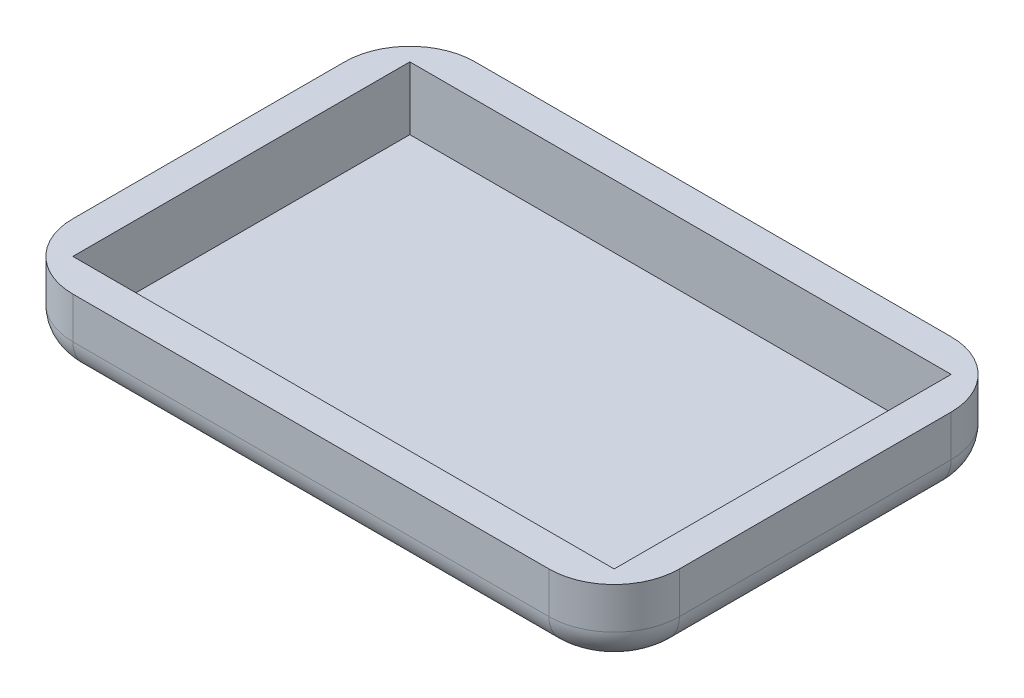
ISO-10303-21;
HEADER;
FILE_DESCRIPTION(('STEP AP214'),'2;1');
FILE_NAME('part.step','',(''),(''),'','','');
FILE_SCHEMA(('AUTOMOTIVE_DESIGN { 1 0 10303 214 1 1 1 1 }'));
ENDSEC;
DATA;
#1=APPLICATION_CONTEXT('core data for automotive mechanical design processes');
#2=APPLICATION_PROTOCOL_DEFINITION('international standard','automotive_design',2000,#1);
#3=PRODUCT_CONTEXT('',#1,'mechanical');
#4=PRODUCT('Part','Part','',(#3));
#5=PRODUCT_RELATED_PRODUCT_CATEGORY('part','',(#4));
#6=PRODUCT_DEFINITION_FORMATION('','',#4);
#7=PRODUCT_DEFINITION_CONTEXT('part definition',#1,'design');
#8=PRODUCT_DEFINITION('design','',#6,#7);
#9=PRODUCT_DEFINITION_SHAPE('','',#8);
#10=(LENGTH_UNIT() NAMED_UNIT(*) SI_UNIT(.MILLI.,.METRE.));
#11=(NAMED_UNIT(*) PLANE_ANGLE_UNIT() SI_UNIT($,.RADIAN.));
#12=(NAMED_UNIT(*) SI_UNIT($,.STERADIAN.) SOLID_ANGLE_UNIT());
#13=UNCERTAINTY_MEASURE_WITH_UNIT(LENGTH_MEASURE(1.E-05),#10,'distance_accuracy_value','');
#14=(GEOMETRIC_REPRESENTATION_CONTEXT(3) GLOBAL_UNCERTAINTY_ASSIGNED_CONTEXT((#13)) GLOBAL_UNIT_ASSIGNED_CONTEXT((#10,
#11,#12)) REPRESENTATION_CONTEXT('',''));
#15=CARTESIAN_POINT('',(0.,0.,0.));
#16=DIRECTION('',(0.,0.,1.));
#17=DIRECTION('',(1.,0.,0.));
#18=AXIS2_PLACEMENT_3D('',#15,#16,#17);
#19=CARTESIAN_POINT('',(0.,8.636,0.));
#20=DIRECTION('',(1.,0.,0.));
#21=DIRECTION('',(0.,0.,-1.));
#22=AXIS2_PLACEMENT_3D('',#19,#20,#21);
#23=PLANE('',#22);
#24=DIRECTION('',(0.,-1.,0.));
#25=VECTOR('',#24,1.);
#26=CARTESIAN_POINT('',(0.,8.636,-39.37));
#27=LINE('',#26,#25);
#28=CARTESIAN_POINT('',(0.,8.636,-39.37));
#29=VERTEX_POINT('',#28);
#30=CARTESIAN_POINT('',(0.,3.81,-39.37));
#31=VERTEX_POINT('',#30);
#32=EDGE_CURVE('E225',#29,#31,#27,.T.);
#33=ORIENTED_EDGE('',*,*,#32,.T.);
#34=DIRECTION('',(0.,0.,1.));
#35=VECTOR('',#34,1.);
#36=CARTESIAN_POINT('',(0.,3.81,-7.62));
#37=LINE('',#36,#35);
#38=CARTESIAN_POINT('',(0.,3.81,-7.62));
#39=VERTEX_POINT('',#38);
#40=EDGE_CURVE('E257',#31,#39,#37,.T.);
#41=ORIENTED_EDGE('',*,*,#40,.T.);
#42=DIRECTION('',(0.,-1.,0.));
#43=VECTOR('',#42,1.);
#44=CARTESIAN_POINT('',(0.,8.636,-7.62));
#45=LINE('',#44,#43);
#46=CARTESIAN_POINT('',(0.,8.636,-7.62));
#47=VERTEX_POINT('',#46);
#48=EDGE_CURVE('E227',#39,#47,#45,.F.);
#49=ORIENTED_EDGE('',*,*,#48,.T.);
#50=DIRECTION('',(0.,0.,1.));
#51=VECTOR('',#50,1.);
#52=CARTESIAN_POINT('',(0.,8.636,0.));
#53=LINE('',#52,#51);
#54=EDGE_CURVE('E188',#29,#47,#53,.T.);
#55=ORIENTED_EDGE('',*,*,#54,.F.);
#56=EDGE_LOOP('',(#33,#41,#49,#55));
#57=FACE_BOUND('',#56,.T.);
#58=ADVANCED_FACE('F35',(#57),#23,.F.);
#59=CARTESIAN_POINT('',(0.,8.636,0.));
#60=DIRECTION('',(0.,0.,-1.));
#61=DIRECTION('',(-1.,0.,0.));
#62=AXIS2_PLACEMENT_3D('',#59,#60,#61);
#63=PLANE('',#62);
#64=DIRECTION('',(0.,-1.,0.));
#65=VECTOR('',#64,1.);
#66=CARTESIAN_POINT('',(7.62,8.636,0.));
#67=LINE('',#66,#65);
#68=CARTESIAN_POINT('',(7.62,8.636,0.));
#69=VERTEX_POINT('',#68);
#70=CARTESIAN_POINT('',(7.62,3.81,0.));
#71=VERTEX_POINT('',#70);
#72=EDGE_CURVE('E220',#69,#71,#67,.T.);
#73=ORIENTED_EDGE('',*,*,#72,.T.);
#74=DIRECTION('',(1.,0.,0.));
#75=VECTOR('',#74,1.);
#76=CARTESIAN_POINT('',(63.246,3.81,0.));
#77=LINE('',#76,#75);
#78=CARTESIAN_POINT('',(63.246,3.81,0.));
#79=VERTEX_POINT('',#78);
#80=EDGE_CURVE('E253',#71,#79,#77,.T.);
#81=ORIENTED_EDGE('',*,*,#80,.T.);
#82=DIRECTION('',(0.,-1.,0.));
#83=VECTOR('',#82,1.);
#84=CARTESIAN_POINT('',(63.246,8.636,0.));
#85=LINE('',#84,#83);
#86=CARTESIAN_POINT('',(63.246,8.636,0.));
#87=VERTEX_POINT('',#86);
#88=EDGE_CURVE('E223',#79,#87,#85,.F.);
#89=ORIENTED_EDGE('',*,*,#88,.T.);
#90=DIRECTION('',(1.,0.,0.));
#91=VECTOR('',#90,1.);
#92=CARTESIAN_POINT('',(0.,8.636,0.));
#93=LINE('',#92,#91);
#94=EDGE_CURVE('E194',#69,#87,#93,.T.);
#95=ORIENTED_EDGE('',*,*,#94,.F.);
#96=EDGE_LOOP('',(#73,#81,#89,#95));
#97=FACE_BOUND('',#96,.T.);
#98=ADVANCED_FACE('F298',(#97),#63,.F.);
#99=CARTESIAN_POINT('',(70.866,8.636,0.));
#100=DIRECTION('',(-1.,0.,0.));
#101=DIRECTION('',(0.,0.,1.));
#102=AXIS2_PLACEMENT_3D('',#99,#100,#101);
#103=PLANE('',#102);
#104=DIRECTION('',(0.,-1.,0.));
#105=VECTOR('',#104,1.);
#106=CARTESIAN_POINT('',(70.866,8.636,-7.62));
#107=LINE('',#106,#105);
#108=CARTESIAN_POINT('',(70.866,8.636,-7.62));
#109=VERTEX_POINT('',#108);
#110=CARTESIAN_POINT('',(70.866,3.81,-7.62));
#111=VERTEX_POINT('',#110);
#112=EDGE_CURVE('E207',#109,#111,#107,.T.);
#113=ORIENTED_EDGE('',*,*,#112,.T.);
#114=DIRECTION('',(0.,0.,-1.));
#115=VECTOR('',#114,1.);
#116=CARTESIAN_POINT('',(70.866,3.81,-39.37));
#117=LINE('',#116,#115);
#118=CARTESIAN_POINT('',(70.866,3.81,-39.37));
#119=VERTEX_POINT('',#118);
#120=EDGE_CURVE('E249',#111,#119,#117,.T.);
#121=ORIENTED_EDGE('',*,*,#120,.T.);
#122=DIRECTION('',(0.,-1.,0.));
#123=VECTOR('',#122,1.);
#124=CARTESIAN_POINT('',(70.866,8.636,-39.37));
#125=LINE('',#124,#123);
#126=CARTESIAN_POINT('',(70.866,8.636,-39.37));
#127=VERTEX_POINT('',#126);
#128=EDGE_CURVE('E210',#119,#127,#125,.F.);
#129=ORIENTED_EDGE('',*,*,#128,.T.);
#130=DIRECTION('',(0.,0.,-1.));
#131=VECTOR('',#130,1.);
#132=CARTESIAN_POINT('',(70.866,8.636,0.));
#133=LINE('',#132,#131);
#134=EDGE_CURVE('E197',#109,#127,#133,.T.);
#135=ORIENTED_EDGE('',*,*,#134,.F.);
#136=EDGE_LOOP('',(#113,#121,#129,#135));
#137=FACE_BOUND('',#136,.T.);
#138=ADVANCED_FACE('F311',(#137),#103,.F.);
#139=CARTESIAN_POINT('',(0.,8.636,-46.99));
#140=DIRECTION('',(0.,0.,1.));
#141=DIRECTION('',(1.,0.,0.));
#142=AXIS2_PLACEMENT_3D('',#139,#140,#141);
#143=PLANE('',#142);
#144=DIRECTION('',(0.,-1.,0.));
#145=VECTOR('',#144,1.);
#146=CARTESIAN_POINT('',(63.246,8.636,-46.99));
#147=LINE('',#146,#145);
#148=CARTESIAN_POINT('',(63.246,8.636,-46.99));
#149=VERTEX_POINT('',#148);
#150=CARTESIAN_POINT('',(63.246,3.81,-46.99));
#151=VERTEX_POINT('',#150);
#152=EDGE_CURVE('E205',#149,#151,#147,.T.);
#153=ORIENTED_EDGE('',*,*,#152,.T.);
#154=DIRECTION('',(-1.,0.,0.));
#155=VECTOR('',#154,1.);
#156=CARTESIAN_POINT('',(7.62,3.81,-46.99));
#157=LINE('',#156,#155);
#158=CARTESIAN_POINT('',(7.62,3.81,-46.99));
#159=VERTEX_POINT('',#158);
#160=EDGE_CURVE('E11',#151,#159,#157,.T.);
#161=ORIENTED_EDGE('',*,*,#160,.T.);
#162=DIRECTION('',(0.,-1.,0.));
#163=VECTOR('',#162,1.);
#164=CARTESIAN_POINT('',(7.62,8.636,-46.99));
#165=LINE('',#164,#163);
#166=CARTESIAN_POINT('',(7.62,8.636,-46.99));
#167=VERTEX_POINT('',#166);
#168=EDGE_CURVE('E203',#159,#167,#165,.F.);
#169=ORIENTED_EDGE('',*,*,#168,.T.);
#170=DIRECTION('',(-1.,0.,0.));
#171=VECTOR('',#170,1.);
#172=CARTESIAN_POINT('',(0.,8.636,-46.99));
#173=LINE('',#172,#171);
#174=EDGE_CURVE('E200',#149,#167,#173,.T.);
#175=ORIENTED_EDGE('',*,*,#174,.F.);
#176=EDGE_LOOP('',(#153,#161,#169,#175));
#177=FACE_BOUND('',#176,.T.);
#178=ADVANCED_FACE('F331',(#177),#143,.F.);
#179=CARTESIAN_POINT('',(0.,8.636,0.));
#180=DIRECTION('',(0.,-1.,0.));
#181=DIRECTION('',(0.,0.,-1.));
#182=AXIS2_PLACEMENT_3D('',#179,#180,#181);
#183=PLANE('',#182);
#184=DIRECTION('',(-1.,0.,0.));
#185=VECTOR('',#184,1.);
#186=CARTESIAN_POINT('',(3.80999999999998,8.636,-43.18));
#187=LINE('',#186,#185);
#188=CARTESIAN_POINT('',(67.056,8.636,-43.18));
#189=VERTEX_POINT('',#188);
#190=CARTESIAN_POINT('',(3.80999999999998,8.636,-43.18));
#191=VERTEX_POINT('',#190);
#192=EDGE_CURVE('E182',#189,#191,#187,.T.);
#193=ORIENTED_EDGE('',*,*,#192,.F.);
#194=DIRECTION('',(0.,0.,-1.));
#195=VECTOR('',#194,1.);
#196=CARTESIAN_POINT('',(67.056,8.636,-3.81));
#197=LINE('',#196,#195);
#198=CARTESIAN_POINT('',(67.056,8.636,-3.81));
#199=VERTEX_POINT('',#198);
#200=EDGE_CURVE('E156',#199,#189,#197,.T.);
#201=ORIENTED_EDGE('',*,*,#200,.F.);
#202=DIRECTION('',(1.,0.,0.));
#203=VECTOR('',#202,1.);
#204=CARTESIAN_POINT('',(3.80999999999998,8.636,-3.81));
#205=LINE('',#204,#203);
#206=CARTESIAN_POINT('',(3.80999999999998,8.636,-3.81));
#207=VERTEX_POINT('',#206);
#208=EDGE_CURVE('E173',#207,#199,#205,.T.);
#209=ORIENTED_EDGE('',*,*,#208,.F.);
#210=DIRECTION('',(0.,0.,1.));
#211=VECTOR('',#210,1.);
#212=CARTESIAN_POINT('',(3.80999999999998,8.636,-3.81));
#213=LINE('',#212,#211);
#214=EDGE_CURVE('E176',#191,#207,#213,.T.);
#215=ORIENTED_EDGE('',*,*,#214,.F.);
#216=EDGE_LOOP('',(#193,#201,#209,#215));
#217=FACE_BOUND('',#216,.T.);
#218=ORIENTED_EDGE('',*,*,#134,.T.);
#219=CARTESIAN_POINT('',(63.246,8.636,-39.37));
#220=DIRECTION('',(0.,-1.,0.));
#221=DIRECTION('',(0.,0.,-1.));
#222=AXIS2_PLACEMENT_3D('',#219,#220,#221);
#223=CIRCLE('',#222,7.62);
#224=EDGE_CURVE('E218',#127,#149,#223,.F.);
#225=ORIENTED_EDGE('',*,*,#224,.T.);
#226=ORIENTED_EDGE('',*,*,#174,.T.);
#227=CARTESIAN_POINT('',(7.62,8.636,-39.37));
#228=DIRECTION('',(0.,-1.,0.));
#229=DIRECTION('',(0.,0.,-1.));
#230=AXIS2_PLACEMENT_3D('',#227,#228,#229);
#231=CIRCLE('',#230,7.62);
#232=EDGE_CURVE('E212',#167,#29,#231,.F.);
#233=ORIENTED_EDGE('',*,*,#232,.T.);
#234=ORIENTED_EDGE('',*,*,#54,.T.);
#235=CARTESIAN_POINT('',(7.62,8.636,-7.62));
#236=DIRECTION('',(0.,-1.,0.));
#237=DIRECTION('',(0.,0.,-1.));
#238=AXIS2_PLACEMENT_3D('',#235,#236,#237);
#239=CIRCLE('',#238,7.62);
#240=EDGE_CURVE('E214',#47,#69,#239,.F.);
#241=ORIENTED_EDGE('',*,*,#240,.T.);
#242=ORIENTED_EDGE('',*,*,#94,.T.);
#243=CARTESIAN_POINT('',(63.246,8.636,-7.62));
#244=DIRECTION('',(0.,-1.,0.));
#245=DIRECTION('',(0.,0.,-1.));
#246=AXIS2_PLACEMENT_3D('',#243,#244,#245);
#247=CIRCLE('',#246,7.62);
#248=EDGE_CURVE('E216',#87,#109,#247,.F.);
#249=ORIENTED_EDGE('',*,*,#248,.T.);
#250=EDGE_LOOP('',(#218,#225,#226,#233,#234,#241,#242,#249));
#251=FACE_BOUND('',#250,.T.);
#252=ADVANCED_FACE('F302',(#217,#251),#183,.F.);
#253=CARTESIAN_POINT('',(0.,0.,0.));
#254=DIRECTION('',(0.,-1.,0.));
#255=DIRECTION('',(0.,0.,-1.));
#256=AXIS2_PLACEMENT_3D('',#253,#254,#255);
#257=PLANE('',#256);
#258=DIRECTION('',(-1.,0.,0.));
#259=VECTOR('',#258,1.);
#260=CARTESIAN_POINT('',(63.246,0.,-43.18));
#261=LINE('',#260,#259);
#262=CARTESIAN_POINT('',(7.62,0.,-43.18));
#263=VERTEX_POINT('',#262);
#264=CARTESIAN_POINT('',(63.246,0.,-43.18));
#265=VERTEX_POINT('',#264);
#266=EDGE_CURVE('E229',#263,#265,#261,.F.);
#267=ORIENTED_EDGE('',*,*,#266,.T.);
#268=CARTESIAN_POINT('',(63.246,0.,-39.37));
#269=DIRECTION('',(0.,-1.,0.));
#270=DIRECTION('',(0.,0.,-1.));
#271=AXIS2_PLACEMENT_3D('',#268,#269,#270);
#272=CIRCLE('',#271,3.81);
#273=CARTESIAN_POINT('',(67.056,0.,-39.37));
#274=VERTEX_POINT('',#273);
#275=EDGE_CURVE('E243',#265,#274,#272,.T.);
#276=ORIENTED_EDGE('',*,*,#275,.T.);
#277=DIRECTION('',(0.,0.,-1.));
#278=VECTOR('',#277,1.);
#279=CARTESIAN_POINT('',(67.056,0.,-7.62));
#280=LINE('',#279,#278);
#281=CARTESIAN_POINT('',(67.056,0.,-7.62));
#282=VERTEX_POINT('',#281);
#283=EDGE_CURVE('E241',#274,#282,#280,.F.);
#284=ORIENTED_EDGE('',*,*,#283,.T.);
#285=CARTESIAN_POINT('',(63.246,0.,-7.62));
#286=DIRECTION('',(0.,-1.,0.));
#287=DIRECTION('',(0.,0.,-1.));
#288=AXIS2_PLACEMENT_3D('',#285,#286,#287);
#289=CIRCLE('',#288,3.81);
#290=CARTESIAN_POINT('',(63.246,0.,-3.81));
#291=VERTEX_POINT('',#290);
#292=EDGE_CURVE('E239',#282,#291,#289,.T.);
#293=ORIENTED_EDGE('',*,*,#292,.T.);
#294=DIRECTION('',(1.,0.,0.));
#295=VECTOR('',#294,1.);
#296=CARTESIAN_POINT('',(7.62,0.,-3.81));
#297=LINE('',#296,#295);
#298=CARTESIAN_POINT('',(7.62,0.,-3.81));
#299=VERTEX_POINT('',#298);
#300=EDGE_CURVE('E237',#291,#299,#297,.F.);
#301=ORIENTED_EDGE('',*,*,#300,.T.);
#302=CARTESIAN_POINT('',(7.62,0.,-7.62));
#303=DIRECTION('',(0.,-1.,0.));
#304=DIRECTION('',(0.,0.,-1.));
#305=AXIS2_PLACEMENT_3D('',#302,#303,#304);
#306=CIRCLE('',#305,3.81);
#307=CARTESIAN_POINT('',(3.81,0.,-7.62));
#308=VERTEX_POINT('',#307);
#309=EDGE_CURVE('E235',#299,#308,#306,.T.);
#310=ORIENTED_EDGE('',*,*,#309,.T.);
#311=DIRECTION('',(0.,0.,1.));
#312=VECTOR('',#311,1.);
#313=CARTESIAN_POINT('',(3.81,0.,-39.37));
#314=LINE('',#313,#312);
#315=CARTESIAN_POINT('',(3.81,0.,-39.37));
#316=VERTEX_POINT('',#315);
#317=EDGE_CURVE('E233',#308,#316,#314,.F.);
#318=ORIENTED_EDGE('',*,*,#317,.T.);
#319=CARTESIAN_POINT('',(7.62,0.,-39.37));
#320=DIRECTION('',(0.,-1.,0.));
#321=DIRECTION('',(0.,0.,-1.));
#322=AXIS2_PLACEMENT_3D('',#319,#320,#321);
#323=CIRCLE('',#322,3.81);
#324=EDGE_CURVE('E231',#316,#263,#323,.T.);
#325=ORIENTED_EDGE('',*,*,#324,.T.);
#326=EDGE_LOOP('',(#267,#276,#284,#293,#301,#310,#318,#325));
#327=FACE_BOUND('',#326,.T.);
#328=ADVANCED_FACE('F426',(#327),#257,.T.);
#329=CARTESIAN_POINT('',(67.056,1.27,-3.81));
#330=DIRECTION('',(1.,0.,0.));
#331=DIRECTION('',(0.,0.,-1.));
#332=AXIS2_PLACEMENT_3D('',#329,#330,#331);
#333=PLANE('',#332);
#334=ORIENTED_EDGE('',*,*,#200,.T.);
#335=DIRECTION('',(0.,1.,0.));
#336=VECTOR('',#335,1.);
#337=CARTESIAN_POINT('',(67.056,1.27,-43.18));
#338=LINE('',#337,#336);
#339=CARTESIAN_POINT('',(67.056,1.27,-43.18));
#340=VERTEX_POINT('',#339);
#341=EDGE_CURVE('E149',#340,#189,#338,.T.);
#342=ORIENTED_EDGE('',*,*,#341,.F.);
#343=DIRECTION('',(0.,0.,-1.));
#344=VECTOR('',#343,1.);
#345=CARTESIAN_POINT('',(67.056,1.27,-3.81));
#346=LINE('',#345,#344);
#347=CARTESIAN_POINT('',(67.056,1.27,-3.81));
#348=VERTEX_POINT('',#347);
#349=EDGE_CURVE('E153',#348,#340,#346,.T.);
#350=ORIENTED_EDGE('',*,*,#349,.F.);
#351=DIRECTION('',(0.,1.,0.));
#352=VECTOR('',#351,1.);
#353=CARTESIAN_POINT('',(67.056,1.27,-3.81));
#354=LINE('',#353,#352);
#355=EDGE_CURVE('E186',#348,#199,#354,.T.);
#356=ORIENTED_EDGE('',*,*,#355,.T.);
#357=EDGE_LOOP('',(#334,#342,#350,#356));
#358=FACE_BOUND('',#357,.T.);
#359=ADVANCED_FACE('F151',(#358),#333,.F.);
#360=CARTESIAN_POINT('',(3.80999999999998,1.27,-3.81));
#361=DIRECTION('',(0.,0.,1.));
#362=DIRECTION('',(1.,0.,0.));
#363=AXIS2_PLACEMENT_3D('',#360,#361,#362);
#364=PLANE('',#363);
#365=ORIENTED_EDGE('',*,*,#208,.T.);
#366=ORIENTED_EDGE('',*,*,#355,.F.);
#367=DIRECTION('',(1.,0.,0.));
#368=VECTOR('',#367,1.);
#369=CARTESIAN_POINT('',(3.80999999999998,1.27,-3.81));
#370=LINE('',#369,#368);
#371=CARTESIAN_POINT('',(3.80999999999998,1.27,-3.81));
#372=VERTEX_POINT('',#371);
#373=EDGE_CURVE('E161',#372,#348,#370,.T.);
#374=ORIENTED_EDGE('',*,*,#373,.F.);
#375=DIRECTION('',(0.,1.,0.));
#376=VECTOR('',#375,1.);
#377=CARTESIAN_POINT('',(3.80999999999998,1.27,-3.81));
#378=LINE('',#377,#376);
#379=EDGE_CURVE('E189',#372,#207,#378,.T.);
#380=ORIENTED_EDGE('',*,*,#379,.T.);
#381=EDGE_LOOP('',(#365,#366,#374,#380));
#382=FACE_BOUND('',#381,.T.);
#383=ADVANCED_FACE('F411',(#382),#364,.F.);
#384=CARTESIAN_POINT('',(3.80999999999998,1.27,-3.81));
#385=DIRECTION('',(-1.,0.,0.));
#386=DIRECTION('',(0.,0.,1.));
#387=AXIS2_PLACEMENT_3D('',#384,#385,#386);
#388=PLANE('',#387);
#389=ORIENTED_EDGE('',*,*,#214,.T.);
#390=ORIENTED_EDGE('',*,*,#379,.F.);
#391=DIRECTION('',(0.,0.,1.));
#392=VECTOR('',#391,1.);
#393=CARTESIAN_POINT('',(3.80999999999998,1.27,-3.81));
#394=LINE('',#393,#392);
#395=CARTESIAN_POINT('',(3.80999999999998,1.27,-43.18));
#396=VERTEX_POINT('',#395);
#397=EDGE_CURVE('E169',#396,#372,#394,.T.);
#398=ORIENTED_EDGE('',*,*,#397,.F.);
#399=DIRECTION('',(0.,1.,0.));
#400=VECTOR('',#399,1.);
#401=CARTESIAN_POINT('',(3.80999999999998,1.27,-43.18));
#402=LINE('',#401,#400);
#403=EDGE_CURVE('E160',#396,#191,#402,.T.);
#404=ORIENTED_EDGE('',*,*,#403,.T.);
#405=EDGE_LOOP('',(#389,#390,#398,#404));
#406=FACE_BOUND('',#405,.T.);
#407=ADVANCED_FACE('F404',(#406),#388,.F.);
#408=CARTESIAN_POINT('',(3.80999999999998,1.27,-43.18));
#409=DIRECTION('',(0.,0.,-1.));
#410=DIRECTION('',(-1.,0.,0.));
#411=AXIS2_PLACEMENT_3D('',#408,#409,#410);
#412=PLANE('',#411);
#413=ORIENTED_EDGE('',*,*,#192,.T.);
#414=ORIENTED_EDGE('',*,*,#403,.F.);
#415=DIRECTION('',(-1.,0.,0.));
#416=VECTOR('',#415,1.);
#417=CARTESIAN_POINT('',(3.80999999999998,1.27,-43.18));
#418=LINE('',#417,#416);
#419=EDGE_CURVE('E164',#340,#396,#418,.T.);
#420=ORIENTED_EDGE('',*,*,#419,.F.);
#421=ORIENTED_EDGE('',*,*,#341,.T.);
#422=EDGE_LOOP('',(#413,#414,#420,#421));
#423=FACE_BOUND('',#422,.T.);
#424=ADVANCED_FACE('F165',(#423),#412,.F.);
#425=CARTESIAN_POINT('',(0.,1.27,0.));
#426=DIRECTION('',(0.,-1.,0.));
#427=DIRECTION('',(0.,0.,-1.));
#428=AXIS2_PLACEMENT_3D('',#425,#426,#427);
#429=PLANE('',#428);
#430=ORIENTED_EDGE('',*,*,#349,.T.);
#431=ORIENTED_EDGE('',*,*,#419,.T.);
#432=ORIENTED_EDGE('',*,*,#397,.T.);
#433=ORIENTED_EDGE('',*,*,#373,.T.);
#434=EDGE_LOOP('',(#430,#431,#432,#433));
#435=FACE_BOUND('',#434,.T.);
#436=ADVANCED_FACE('F171',(#435),#429,.F.);
#437=CARTESIAN_POINT('',(63.246,8.636,-39.37));
#438=DIRECTION('',(0.,-1.,0.));
#439=DIRECTION('',(0.,0.,-1.));
#440=AXIS2_PLACEMENT_3D('',#437,#438,#439);
#441=CYLINDRICAL_SURFACE('',#440,7.62);
#442=ORIENTED_EDGE('',*,*,#128,.F.);
#443=CARTESIAN_POINT('',(63.246,3.81,-39.37));
#444=DIRECTION('',(0.,-1.,0.));
#445=DIRECTION('',(0.,0.,-1.));
#446=AXIS2_PLACEMENT_3D('',#443,#444,#445);
#447=CIRCLE('',#446,7.62);
#448=EDGE_CURVE('E246',#119,#151,#447,.F.);
#449=ORIENTED_EDGE('',*,*,#448,.T.);
#450=ORIENTED_EDGE('',*,*,#152,.F.);
#451=ORIENTED_EDGE('',*,*,#224,.F.);
#452=EDGE_LOOP('',(#442,#449,#450,#451));
#453=FACE_BOUND('',#452,.T.);
#454=ADVANCED_FACE('F328',(#453),#441,.T.);
#455=CARTESIAN_POINT('',(63.246,8.636,-7.62));
#456=DIRECTION('',(0.,-1.,0.));
#457=DIRECTION('',(0.,0.,-1.));
#458=AXIS2_PLACEMENT_3D('',#455,#456,#457);
#459=CYLINDRICAL_SURFACE('',#458,7.62);
#460=ORIENTED_EDGE('',*,*,#88,.F.);
#461=CARTESIAN_POINT('',(63.246,3.81,-7.62));
#462=DIRECTION('',(0.,-1.,0.));
#463=DIRECTION('',(0.,0.,-1.));
#464=AXIS2_PLACEMENT_3D('',#461,#462,#463);
#465=CIRCLE('',#464,7.62);
#466=EDGE_CURVE('E251',#79,#111,#465,.F.);
#467=ORIENTED_EDGE('',*,*,#466,.T.);
#468=ORIENTED_EDGE('',*,*,#112,.F.);
#469=ORIENTED_EDGE('',*,*,#248,.F.);
#470=EDGE_LOOP('',(#460,#467,#468,#469));
#471=FACE_BOUND('',#470,.T.);
#472=ADVANCED_FACE('F306',(#471),#459,.T.);
#473=CARTESIAN_POINT('',(7.62,8.636,-7.62));
#474=DIRECTION('',(0.,-1.,0.));
#475=DIRECTION('',(0.,0.,-1.));
#476=AXIS2_PLACEMENT_3D('',#473,#474,#475);
#477=CYLINDRICAL_SURFACE('',#476,7.62);
#478=ORIENTED_EDGE('',*,*,#48,.F.);
#479=CARTESIAN_POINT('',(7.62,3.81,-7.62));
#480=DIRECTION('',(0.,-1.,0.));
#481=DIRECTION('',(0.,0.,-1.));
#482=AXIS2_PLACEMENT_3D('',#479,#480,#481);
#483=CIRCLE('',#482,7.62);
#484=EDGE_CURVE('E255',#39,#71,#483,.F.);
#485=ORIENTED_EDGE('',*,*,#484,.T.);
#486=ORIENTED_EDGE('',*,*,#72,.F.);
#487=ORIENTED_EDGE('',*,*,#240,.F.);
#488=EDGE_LOOP('',(#478,#485,#486,#487));
#489=FACE_BOUND('',#488,.T.);
#490=ADVANCED_FACE('F294',(#489),#477,.T.);
#491=CARTESIAN_POINT('',(7.62,8.636,-39.37));
#492=DIRECTION('',(0.,-1.,0.));
#493=DIRECTION('',(0.,0.,-1.));
#494=AXIS2_PLACEMENT_3D('',#491,#492,#493);
#495=CYLINDRICAL_SURFACE('',#494,7.62);
#496=ORIENTED_EDGE('',*,*,#168,.F.);
#497=CARTESIAN_POINT('',(7.62,3.81,-39.37));
#498=DIRECTION('',(0.,-1.,0.));
#499=DIRECTION('',(0.,0.,-1.));
#500=AXIS2_PLACEMENT_3D('',#497,#498,#499);
#501=CIRCLE('',#500,7.62);
#502=EDGE_CURVE('E44',#159,#31,#501,.F.);
#503=ORIENTED_EDGE('',*,*,#502,.T.);
#504=ORIENTED_EDGE('',*,*,#32,.F.);
#505=ORIENTED_EDGE('',*,*,#232,.F.);
#506=EDGE_LOOP('',(#496,#503,#504,#505));
#507=FACE_BOUND('',#506,.T.);
#508=ADVANCED_FACE('F334',(#507),#495,.T.);
#509=CARTESIAN_POINT('',(7.62,3.81,-7.62));
#510=DIRECTION('',(0.,-1.,0.));
#511=DIRECTION('',(0.,0.,-1.));
#512=AXIS2_PLACEMENT_3D('',#509,#510,#511);
#513=DEGENERATE_TOROIDAL_SURFACE('',#512,3.81,3.81,.T.);
#514=CARTESIAN_POINT('',(7.62,3.81,-3.81));
#515=DIRECTION('',(1.,0.,0.));
#516=DIRECTION('',(0.,0.,-1.));
#517=AXIS2_PLACEMENT_3D('',#514,#515,#516);
#518=CIRCLE('',#517,3.81);
#519=EDGE_CURVE('E275',#71,#299,#518,.T.);
#520=ORIENTED_EDGE('',*,*,#519,.F.);
#521=ORIENTED_EDGE('',*,*,#484,.F.);
#522=CARTESIAN_POINT('',(3.81,3.81,-7.62));
#523=DIRECTION('',(0.,0.,-1.));
#524=DIRECTION('',(-1.,0.,0.));
#525=AXIS2_PLACEMENT_3D('',#522,#523,#524);
#526=CIRCLE('',#525,3.81);
#527=EDGE_CURVE('E39',#308,#39,#526,.T.);
#528=ORIENTED_EDGE('',*,*,#527,.F.);
#529=ORIENTED_EDGE('',*,*,#309,.F.);
#530=EDGE_LOOP('',(#520,#521,#528,#529));
#531=FACE_BOUND('',#530,.T.);
#532=ADVANCED_FACE('F37',(#531),#513,.T.);
#533=CARTESIAN_POINT('',(3.81,3.81,0.));
#534=DIRECTION('',(0.,0.,-1.));
#535=DIRECTION('',(-1.,0.,0.));
#536=AXIS2_PLACEMENT_3D('',#533,#534,#535);
#537=CYLINDRICAL_SURFACE('',#536,3.81);
#538=ORIENTED_EDGE('',*,*,#527,.T.);
#539=ORIENTED_EDGE('',*,*,#40,.F.);
#540=CARTESIAN_POINT('',(3.81,3.81,-39.37));
#541=DIRECTION('',(0.,0.,-1.));
#542=DIRECTION('',(-1.,0.,0.));
#543=AXIS2_PLACEMENT_3D('',#540,#541,#542);
#544=CIRCLE('',#543,3.81);
#545=EDGE_CURVE('E273',#316,#31,#544,.T.);
#546=ORIENTED_EDGE('',*,*,#545,.F.);
#547=ORIENTED_EDGE('',*,*,#317,.F.);
#548=EDGE_LOOP('',(#538,#539,#546,#547));
#549=FACE_BOUND('',#548,.T.);
#550=ADVANCED_FACE('F286',(#549),#537,.T.);
#551=CARTESIAN_POINT('',(0.,3.81,-3.81));
#552=DIRECTION('',(-1.,0.,0.));
#553=DIRECTION('',(0.,0.,1.));
#554=AXIS2_PLACEMENT_3D('',#551,#552,#553);
#555=CYLINDRICAL_SURFACE('',#554,3.81);
#556=ORIENTED_EDGE('',*,*,#519,.T.);
#557=ORIENTED_EDGE('',*,*,#300,.F.);
#558=CARTESIAN_POINT('',(63.246,3.81,-3.81));
#559=DIRECTION('',(1.,0.,0.));
#560=DIRECTION('',(0.,0.,-1.));
#561=AXIS2_PLACEMENT_3D('',#558,#559,#560);
#562=CIRCLE('',#561,3.81);
#563=EDGE_CURVE('E270',#79,#291,#562,.T.);
#564=ORIENTED_EDGE('',*,*,#563,.F.);
#565=ORIENTED_EDGE('',*,*,#80,.F.);
#566=EDGE_LOOP('',(#556,#557,#564,#565));
#567=FACE_BOUND('',#566,.T.);
#568=ADVANCED_FACE('F365',(#567),#555,.T.);
#569=CARTESIAN_POINT('',(7.62,3.81,-39.37));
#570=DIRECTION('',(0.,-1.,0.));
#571=DIRECTION('',(0.,0.,-1.));
#572=AXIS2_PLACEMENT_3D('',#569,#570,#571);
#573=DEGENERATE_TOROIDAL_SURFACE('',#572,3.81,3.81,.T.);
#574=ORIENTED_EDGE('',*,*,#545,.T.);
#575=ORIENTED_EDGE('',*,*,#502,.F.);
#576=CARTESIAN_POINT('',(7.62,3.81,-43.18));
#577=DIRECTION('',(1.,0.,0.));
#578=DIRECTION('',(0.,0.,-1.));
#579=AXIS2_PLACEMENT_3D('',#576,#577,#578);
#580=CIRCLE('',#579,3.81);
#581=EDGE_CURVE('E267',#263,#159,#580,.T.);
#582=ORIENTED_EDGE('',*,*,#581,.F.);
#583=ORIENTED_EDGE('',*,*,#324,.F.);
#584=EDGE_LOOP('',(#574,#575,#582,#583));
#585=FACE_BOUND('',#584,.T.);
#586=ADVANCED_FACE('F362',(#585),#573,.T.);
#587=CARTESIAN_POINT('',(63.246,3.81,-7.62));
#588=DIRECTION('',(0.,-1.,0.));
#589=DIRECTION('',(0.,0.,-1.));
#590=AXIS2_PLACEMENT_3D('',#587,#588,#589);
#591=DEGENERATE_TOROIDAL_SURFACE('',#590,3.81,3.81,.T.);
#592=ORIENTED_EDGE('',*,*,#563,.T.);
#593=ORIENTED_EDGE('',*,*,#292,.F.);
#594=CARTESIAN_POINT('',(67.056,3.81,-7.62));
#595=DIRECTION('',(0.,0.,-1.));
#596=DIRECTION('',(-1.,0.,0.));
#597=AXIS2_PLACEMENT_3D('',#594,#595,#596);
#598=CIRCLE('',#597,3.81);
#599=EDGE_CURVE('E264',#111,#282,#598,.T.);
#600=ORIENTED_EDGE('',*,*,#599,.F.);
#601=ORIENTED_EDGE('',*,*,#466,.F.);
#602=EDGE_LOOP('',(#592,#593,#600,#601));
#603=FACE_BOUND('',#602,.T.);
#604=ADVANCED_FACE('F316',(#603),#591,.T.);
#605=CARTESIAN_POINT('',(0.,3.81,-43.18));
#606=DIRECTION('',(1.,0.,0.));
#607=DIRECTION('',(0.,0.,-1.));
#608=AXIS2_PLACEMENT_3D('',#605,#606,#607);
#609=CYLINDRICAL_SURFACE('',#608,3.81);
#610=ORIENTED_EDGE('',*,*,#581,.T.);
#611=ORIENTED_EDGE('',*,*,#160,.F.);
#612=CARTESIAN_POINT('',(63.246,3.81,-43.18));
#613=DIRECTION('',(1.,0.,0.));
#614=DIRECTION('',(0.,0.,-1.));
#615=AXIS2_PLACEMENT_3D('',#612,#613,#614);
#616=CIRCLE('',#615,3.81);
#617=EDGE_CURVE('E262',#265,#151,#616,.T.);
#618=ORIENTED_EDGE('',*,*,#617,.F.);
#619=ORIENTED_EDGE('',*,*,#266,.F.);
#620=EDGE_LOOP('',(#610,#611,#618,#619));
#621=FACE_BOUND('',#620,.T.);
#622=ADVANCED_FACE('F356',(#621),#609,.T.);
#623=CARTESIAN_POINT('',(67.056,3.81,0.));
#624=DIRECTION('',(0.,0.,1.));
#625=DIRECTION('',(1.,0.,0.));
#626=AXIS2_PLACEMENT_3D('',#623,#624,#625);
#627=CYLINDRICAL_SURFACE('',#626,3.81);
#628=ORIENTED_EDGE('',*,*,#599,.T.);
#629=ORIENTED_EDGE('',*,*,#283,.F.);
#630=CARTESIAN_POINT('',(67.056,3.81,-39.37));
#631=DIRECTION('',(0.,0.,-1.));
#632=DIRECTION('',(-1.,0.,0.));
#633=AXIS2_PLACEMENT_3D('',#630,#631,#632);
#634=CIRCLE('',#633,3.81);
#635=EDGE_CURVE('E260',#119,#274,#634,.T.);
#636=ORIENTED_EDGE('',*,*,#635,.F.);
#637=ORIENTED_EDGE('',*,*,#120,.F.);
#638=EDGE_LOOP('',(#628,#629,#636,#637));
#639=FACE_BOUND('',#638,.T.);
#640=ADVANCED_FACE('F320',(#639),#627,.T.);
#641=CARTESIAN_POINT('',(63.246,3.81,-39.37));
#642=DIRECTION('',(0.,-1.,0.));
#643=DIRECTION('',(0.,0.,-1.));
#644=AXIS2_PLACEMENT_3D('',#641,#642,#643);
#645=DEGENERATE_TOROIDAL_SURFACE('',#644,3.81,3.81,.T.);
#646=ORIENTED_EDGE('',*,*,#617,.T.);
#647=ORIENTED_EDGE('',*,*,#448,.F.);
#648=ORIENTED_EDGE('',*,*,#635,.T.);
#649=ORIENTED_EDGE('',*,*,#275,.F.);
#650=EDGE_LOOP('',(#646,#647,#648,#649));
#651=FACE_BOUND('',#650,.T.);
#652=ADVANCED_FACE('F324',(#651),#645,.T.);
#653=CLOSED_SHELL('',(#58,#98,#138,#178,#252,#328,#359,#383,#407,#424,#436,#454,#472,#490,#508,
#532,#550,#568,#586,#604,#622,#640,#652));
#654=MANIFOLD_SOLID_BREP('B2',#653);
#655=ADVANCED_BREP_SHAPE_REPRESENTATION('',(#18,#654),#14);
#656=SHAPE_DEFINITION_REPRESENTATION(#9,#655);
ENDSEC;
END-ISO-10303-21;
